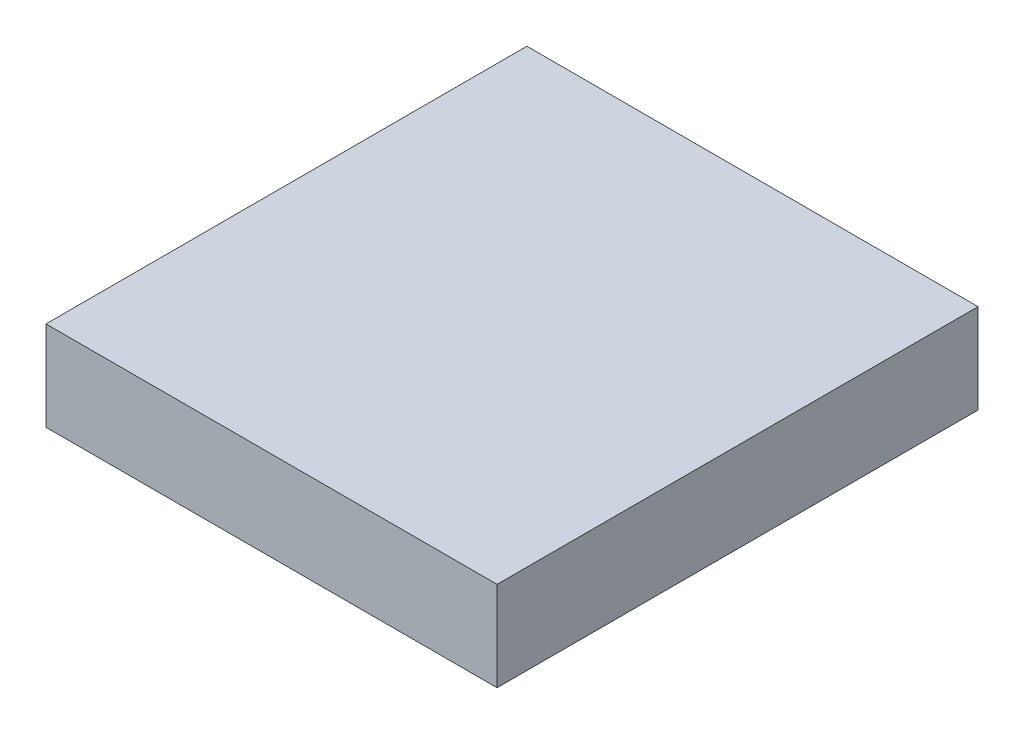
ISO-10303-21;
HEADER;
FILE_DESCRIPTION(('STEP AP214'),'2;1');
FILE_NAME('part.step','',(''),(''),'','','');
FILE_SCHEMA(('AUTOMOTIVE_DESIGN { 1 0 10303 214 1 1 1 1 }'));
ENDSEC;
DATA;
#1=APPLICATION_CONTEXT('core data for automotive mechanical design processes');
#2=APPLICATION_PROTOCOL_DEFINITION('international standard','automotive_design',2000,#1);
#3=PRODUCT_CONTEXT('',#1,'mechanical');
#4=PRODUCT('Part','Part','',(#3));
#5=PRODUCT_RELATED_PRODUCT_CATEGORY('part','',(#4));
#6=PRODUCT_DEFINITION_FORMATION('','',#4);
#7=PRODUCT_DEFINITION_CONTEXT('part definition',#1,'design');
#8=PRODUCT_DEFINITION('design','',#6,#7);
#9=PRODUCT_DEFINITION_SHAPE('','',#8);
#10=(LENGTH_UNIT() NAMED_UNIT(*) SI_UNIT(.MILLI.,.METRE.));
#11=(NAMED_UNIT(*) PLANE_ANGLE_UNIT() SI_UNIT($,.RADIAN.));
#12=(NAMED_UNIT(*) SI_UNIT($,.STERADIAN.) SOLID_ANGLE_UNIT());
#13=UNCERTAINTY_MEASURE_WITH_UNIT(LENGTH_MEASURE(1.E-05),#10,'distance_accuracy_value','');
#14=(GEOMETRIC_REPRESENTATION_CONTEXT(3) GLOBAL_UNCERTAINTY_ASSIGNED_CONTEXT((#13)) GLOBAL_UNIT_ASSIGNED_CONTEXT((#10,
#11,#12)) REPRESENTATION_CONTEXT('',''));
#15=CARTESIAN_POINT('',(0.,0.,0.));
#16=DIRECTION('',(0.,0.,1.));
#17=DIRECTION('',(1.,0.,0.));
#18=AXIS2_PLACEMENT_3D('',#15,#16,#17);
#19=CARTESIAN_POINT('',(215.9,85.725,230.1875));
#20=DIRECTION('',(-1.,0.,0.));
#21=DIRECTION('',(0.,0.,1.));
#22=AXIS2_PLACEMENT_3D('',#19,#20,#21);
#23=PLANE('',#22);
#24=DIRECTION('',(0.,0.,-1.));
#25=VECTOR('',#24,1.);
#26=CARTESIAN_POINT('',(215.9,0.,230.1875));
#27=LINE('',#26,#25);
#28=CARTESIAN_POINT('',(215.9,0.,230.1875));
#29=VERTEX_POINT('',#28);
#30=CARTESIAN_POINT('',(215.9,0.,-230.1875));
#31=VERTEX_POINT('',#30);
#32=EDGE_CURVE('E107',#29,#31,#27,.T.);
#33=ORIENTED_EDGE('',*,*,#32,.T.);
#34=DIRECTION('',(0.,-1.,0.));
#35=VECTOR('',#34,1.);
#36=CARTESIAN_POINT('',(215.9,85.725,-230.1875));
#37=LINE('',#36,#35);
#38=CARTESIAN_POINT('',(215.9,85.725,-230.1875));
#39=VERTEX_POINT('',#38);
#40=EDGE_CURVE('E11',#39,#31,#37,.T.);
#41=ORIENTED_EDGE('',*,*,#40,.F.);
#42=DIRECTION('',(0.,0.,-1.));
#43=VECTOR('',#42,1.);
#44=CARTESIAN_POINT('',(215.9,85.725,230.1875));
#45=LINE('',#44,#43);
#46=CARTESIAN_POINT('',(215.9,85.725,230.1875));
#47=VERTEX_POINT('',#46);
#48=EDGE_CURVE('E91',#47,#39,#45,.T.);
#49=ORIENTED_EDGE('',*,*,#48,.F.);
#50=DIRECTION('',(0.,-1.,0.));
#51=VECTOR('',#50,1.);
#52=CARTESIAN_POINT('',(215.9,85.725,230.1875));
#53=LINE('',#52,#51);
#54=EDGE_CURVE('E103',#47,#29,#53,.T.);
#55=ORIENTED_EDGE('',*,*,#54,.T.);
#56=EDGE_LOOP('',(#33,#41,#49,#55));
#57=FACE_BOUND('',#56,.T.);
#58=ADVANCED_FACE('F39',(#57),#23,.F.);
#59=CARTESIAN_POINT('',(-215.9,85.725,-230.1875));
#60=DIRECTION('',(0.,0.,1.));
#61=DIRECTION('',(1.,0.,0.));
#62=AXIS2_PLACEMENT_3D('',#59,#60,#61);
#63=PLANE('',#62);
#64=DIRECTION('',(-1.,0.,0.));
#65=VECTOR('',#64,1.);
#66=CARTESIAN_POINT('',(-215.9,0.,-230.1875));
#67=LINE('',#66,#65);
#68=CARTESIAN_POINT('',(-215.9,0.,-230.1875));
#69=VERTEX_POINT('',#68);
#70=EDGE_CURVE('E96',#31,#69,#67,.T.);
#71=ORIENTED_EDGE('',*,*,#70,.T.);
#72=DIRECTION('',(0.,-1.,0.));
#73=VECTOR('',#72,1.);
#74=CARTESIAN_POINT('',(-215.9,85.725,-230.1875));
#75=LINE('',#74,#73);
#76=CARTESIAN_POINT('',(-215.9,85.725,-230.1875));
#77=VERTEX_POINT('',#76);
#78=EDGE_CURVE('E48',#77,#69,#75,.T.);
#79=ORIENTED_EDGE('',*,*,#78,.F.);
#80=DIRECTION('',(-1.,0.,0.));
#81=VECTOR('',#80,1.);
#82=CARTESIAN_POINT('',(-215.9,85.725,-230.1875));
#83=LINE('',#82,#81);
#84=EDGE_CURVE('E86',#39,#77,#83,.T.);
#85=ORIENTED_EDGE('',*,*,#84,.F.);
#86=ORIENTED_EDGE('',*,*,#40,.T.);
#87=EDGE_LOOP('',(#71,#79,#85,#86));
#88=FACE_BOUND('',#87,.T.);
#89=ADVANCED_FACE('F95',(#88),#63,.F.);
#90=CARTESIAN_POINT('',(-215.9,85.725,230.1875));
#91=DIRECTION('',(1.,0.,0.));
#92=DIRECTION('',(0.,0.,-1.));
#93=AXIS2_PLACEMENT_3D('',#90,#91,#92);
#94=PLANE('',#93);
#95=DIRECTION('',(0.,0.,1.));
#96=VECTOR('',#95,1.);
#97=CARTESIAN_POINT('',(-215.9,0.,230.1875));
#98=LINE('',#97,#96);
#99=CARTESIAN_POINT('',(-215.9,0.,230.1875));
#100=VERTEX_POINT('',#99);
#101=EDGE_CURVE('E73',#69,#100,#98,.T.);
#102=ORIENTED_EDGE('',*,*,#101,.T.);
#103=DIRECTION('',(0.,-1.,0.));
#104=VECTOR('',#103,1.);
#105=CARTESIAN_POINT('',(-215.9,85.725,230.1875));
#106=LINE('',#105,#104);
#107=CARTESIAN_POINT('',(-215.9,85.725,230.1875));
#108=VERTEX_POINT('',#107);
#109=EDGE_CURVE('E98',#108,#100,#106,.T.);
#110=ORIENTED_EDGE('',*,*,#109,.F.);
#111=DIRECTION('',(0.,0.,1.));
#112=VECTOR('',#111,1.);
#113=CARTESIAN_POINT('',(-215.9,85.725,230.1875));
#114=LINE('',#113,#112);
#115=EDGE_CURVE('E89',#77,#108,#114,.T.);
#116=ORIENTED_EDGE('',*,*,#115,.F.);
#117=ORIENTED_EDGE('',*,*,#78,.T.);
#118=EDGE_LOOP('',(#102,#110,#116,#117));
#119=FACE_BOUND('',#118,.T.);
#120=ADVANCED_FACE('F99',(#119),#94,.F.);
#121=CARTESIAN_POINT('',(-215.9,85.725,230.1875));
#122=DIRECTION('',(0.,0.,-1.));
#123=DIRECTION('',(-1.,0.,0.));
#124=AXIS2_PLACEMENT_3D('',#121,#122,#123);
#125=PLANE('',#124);
#126=DIRECTION('',(1.,0.,0.));
#127=VECTOR('',#126,1.);
#128=CARTESIAN_POINT('',(-215.9,0.,230.1875));
#129=LINE('',#128,#127);
#130=EDGE_CURVE('E79',#100,#29,#129,.T.);
#131=ORIENTED_EDGE('',*,*,#130,.T.);
#132=ORIENTED_EDGE('',*,*,#54,.F.);
#133=DIRECTION('',(1.,0.,0.));
#134=VECTOR('',#133,1.);
#135=CARTESIAN_POINT('',(-215.9,85.725,230.1875));
#136=LINE('',#135,#134);
#137=EDGE_CURVE('E56',#108,#47,#136,.T.);
#138=ORIENTED_EDGE('',*,*,#137,.F.);
#139=ORIENTED_EDGE('',*,*,#109,.T.);
#140=EDGE_LOOP('',(#131,#132,#138,#139));
#141=FACE_BOUND('',#140,.T.);
#142=ADVANCED_FACE('F120',(#141),#125,.F.);
#143=CARTESIAN_POINT('',(0.,85.725,0.));
#144=DIRECTION('',(0.,-1.,0.));
#145=DIRECTION('',(0.,0.,-1.));
#146=AXIS2_PLACEMENT_3D('',#143,#144,#145);
#147=PLANE('',#146);
#148=ORIENTED_EDGE('',*,*,#48,.T.);
#149=ORIENTED_EDGE('',*,*,#84,.T.);
#150=ORIENTED_EDGE('',*,*,#115,.T.);
#151=ORIENTED_EDGE('',*,*,#137,.T.);
#152=EDGE_LOOP('',(#148,#149,#150,#151));
#153=FACE_BOUND('',#152,.T.);
#154=ADVANCED_FACE('F87',(#153),#147,.F.);
#155=CARTESIAN_POINT('',(0.,0.,0.));
#156=DIRECTION('',(0.,-1.,0.));
#157=DIRECTION('',(0.,0.,-1.));
#158=AXIS2_PLACEMENT_3D('',#155,#156,#157);
#159=PLANE('',#158);
#160=ORIENTED_EDGE('',*,*,#32,.F.);
#161=ORIENTED_EDGE('',*,*,#130,.F.);
#162=ORIENTED_EDGE('',*,*,#101,.F.);
#163=ORIENTED_EDGE('',*,*,#70,.F.);
#164=EDGE_LOOP('',(#160,#161,#162,#163));
#165=FACE_BOUND('',#164,.T.);
#166=ADVANCED_FACE('F123',(#165),#159,.T.);
#167=CLOSED_SHELL('',(#58,#89,#120,#142,#154,#166));
#168=MANIFOLD_SOLID_BREP('B2',#167);
#169=ADVANCED_BREP_SHAPE_REPRESENTATION('',(#18,#168),#14);
#170=SHAPE_DEFINITION_REPRESENTATION(#9,#169);
ENDSEC;
END-ISO-10303-21;
